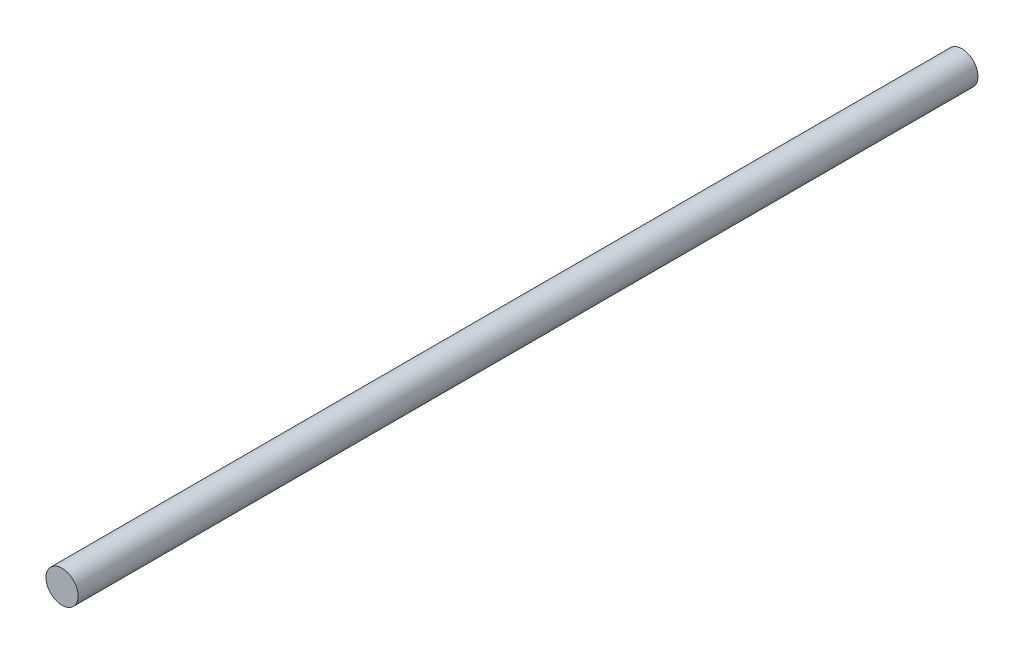
ISO-10303-21;
HEADER;
FILE_DESCRIPTION(('STEP AP214'),'2;1');
FILE_NAME('part.step','',(''),(''),'','','');
FILE_SCHEMA(('AUTOMOTIVE_DESIGN { 1 0 10303 214 1 1 1 1 }'));
ENDSEC;
DATA;
#1=APPLICATION_CONTEXT('core data for automotive mechanical design processes');
#2=APPLICATION_PROTOCOL_DEFINITION('international standard','automotive_design',2000,#1);
#3=PRODUCT_CONTEXT('',#1,'mechanical');
#4=PRODUCT('Part','Part','',(#3));
#5=PRODUCT_RELATED_PRODUCT_CATEGORY('part','',(#4));
#6=PRODUCT_DEFINITION_FORMATION('','',#4);
#7=PRODUCT_DEFINITION_CONTEXT('part definition',#1,'design');
#8=PRODUCT_DEFINITION('design','',#6,#7);
#9=PRODUCT_DEFINITION_SHAPE('','',#8);
#10=(LENGTH_UNIT() NAMED_UNIT(*) SI_UNIT(.MILLI.,.METRE.));
#11=(NAMED_UNIT(*) PLANE_ANGLE_UNIT() SI_UNIT($,.RADIAN.));
#12=(NAMED_UNIT(*) SI_UNIT($,.STERADIAN.) SOLID_ANGLE_UNIT());
#13=UNCERTAINTY_MEASURE_WITH_UNIT(LENGTH_MEASURE(1.E-05),#10,'distance_accuracy_value','');
#14=(GEOMETRIC_REPRESENTATION_CONTEXT(3) GLOBAL_UNCERTAINTY_ASSIGNED_CONTEXT((#13)) GLOBAL_UNIT_ASSIGNED_CONTEXT((#10,
#11,#12)) REPRESENTATION_CONTEXT('',''));
#15=CARTESIAN_POINT('',(0.,0.,0.));
#16=DIRECTION('',(0.,0.,1.));
#17=DIRECTION('',(1.,0.,0.));
#18=AXIS2_PLACEMENT_3D('',#15,#16,#17);
#19=CARTESIAN_POINT('',(0.,0.,280.));
#20=DIRECTION('',(0.,0.,-1.));
#21=DIRECTION('',(-1.,0.,0.));
#22=AXIS2_PLACEMENT_3D('',#19,#20,#21);
#23=CYLINDRICAL_SURFACE('',#22,5.);
#24=CARTESIAN_POINT('',(0.,0.,280.));
#25=DIRECTION('',(0.,0.,1.));
#26=DIRECTION('',(1.,0.,0.));
#27=AXIS2_PLACEMENT_3D('',#24,#25,#26);
#28=CIRCLE('',#27,5.);
#29=CARTESIAN_POINT('',(5.,0.,280.));
#30=VERTEX_POINT('',#29);
#31=EDGE_CURVE('E10',#30,#30,#28,.T.);
#32=ORIENTED_EDGE('',*,*,#31,.F.);
#33=EDGE_LOOP('',(#32));
#34=FACE_BOUND('',#33,.T.);
#35=CARTESIAN_POINT('',(0.,0.,0.));
#36=DIRECTION('',(0.,0.,1.));
#37=DIRECTION('',(1.,0.,0.));
#38=AXIS2_PLACEMENT_3D('',#35,#36,#37);
#39=CIRCLE('',#38,5.);
#40=CARTESIAN_POINT('',(5.,0.,0.));
#41=VERTEX_POINT('',#40);
#42=EDGE_CURVE('E44',#41,#41,#39,.T.);
#43=ORIENTED_EDGE('',*,*,#42,.T.);
#44=EDGE_LOOP('',(#43));
#45=FACE_BOUND('',#44,.T.);
#46=ADVANCED_FACE('F41',(#34,#45),#23,.T.);
#47=CARTESIAN_POINT('',(0.,0.,280.));
#48=DIRECTION('',(0.,0.,1.));
#49=DIRECTION('',(1.,0.,0.));
#50=AXIS2_PLACEMENT_3D('',#47,#48,#49);
#51=PLANE('',#50);
#52=ORIENTED_EDGE('',*,*,#31,.T.);
#53=EDGE_LOOP('',(#52));
#54=FACE_BOUND('',#53,.T.);
#55=ADVANCED_FACE('F58',(#54),#51,.T.);
#56=CARTESIAN_POINT('',(0.,0.,0.));
#57=DIRECTION('',(0.,0.,1.));
#58=DIRECTION('',(1.,0.,0.));
#59=AXIS2_PLACEMENT_3D('',#56,#57,#58);
#60=PLANE('',#59);
#61=ORIENTED_EDGE('',*,*,#42,.F.);
#62=EDGE_LOOP('',(#61));
#63=FACE_BOUND('',#62,.T.);
#64=ADVANCED_FACE('F56',(#63),#60,.F.);
#65=CLOSED_SHELL('',(#46,#55,#64));
#66=MANIFOLD_SOLID_BREP('B2',#65);
#67=ADVANCED_BREP_SHAPE_REPRESENTATION('',(#18,#66),#14);
#68=SHAPE_DEFINITION_REPRESENTATION(#9,#67);
ENDSEC;
END-ISO-10303-21;
